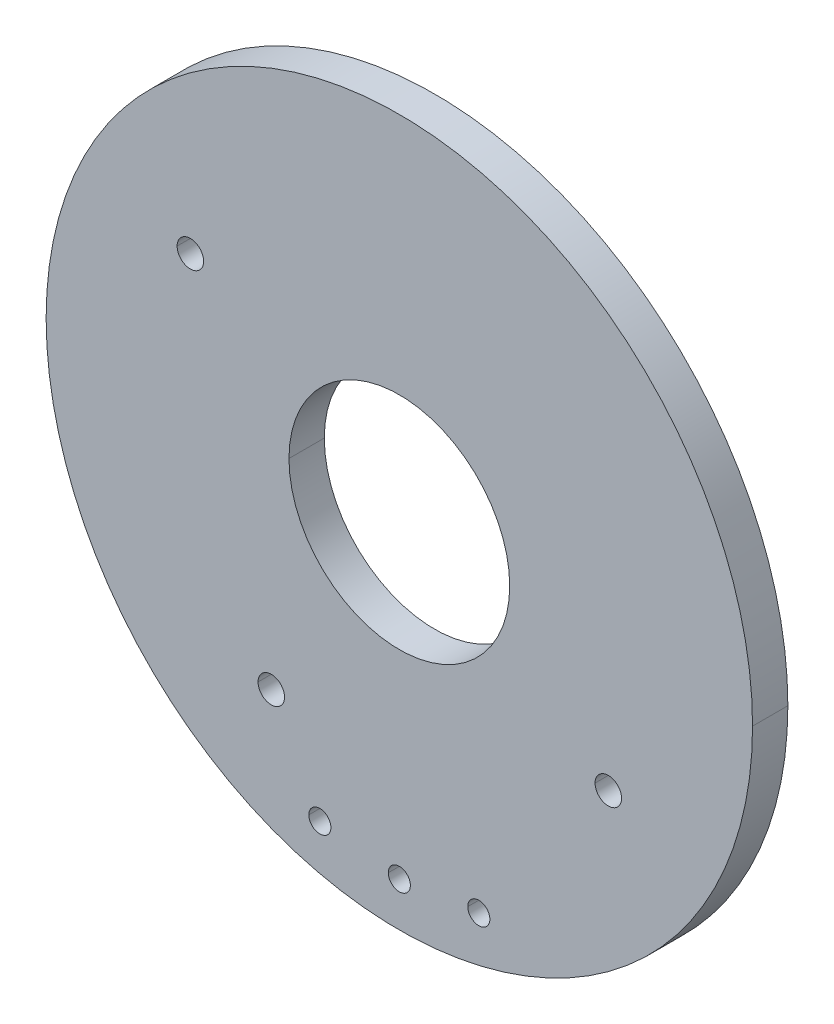
ISO-10303-21;
HEADER;
FILE_DESCRIPTION(('STEP AP214'),'2;1');
FILE_NAME('part.step','',(''),(''),'','','');
FILE_SCHEMA(('AUTOMOTIVE_DESIGN { 1 0 10303 214 1 1 1 1 }'));
ENDSEC;
DATA;
#1=APPLICATION_CONTEXT('core data for automotive mechanical design processes');
#2=APPLICATION_PROTOCOL_DEFINITION('international standard','automotive_design',2000,#1);
#3=PRODUCT_CONTEXT('',#1,'mechanical');
#4=PRODUCT('Part','Part','',(#3));
#5=PRODUCT_RELATED_PRODUCT_CATEGORY('part','',(#4));
#6=PRODUCT_DEFINITION_FORMATION('','',#4);
#7=PRODUCT_DEFINITION_CONTEXT('part definition',#1,'design');
#8=PRODUCT_DEFINITION('design','',#6,#7);
#9=PRODUCT_DEFINITION_SHAPE('','',#8);
#10=(LENGTH_UNIT() NAMED_UNIT(*) SI_UNIT(.MILLI.,.METRE.));
#11=(NAMED_UNIT(*) PLANE_ANGLE_UNIT() SI_UNIT($,.RADIAN.));
#12=(NAMED_UNIT(*) SI_UNIT($,.STERADIAN.) SOLID_ANGLE_UNIT());
#13=UNCERTAINTY_MEASURE_WITH_UNIT(LENGTH_MEASURE(1.E-05),#10,'distance_accuracy_value','');
#14=(GEOMETRIC_REPRESENTATION_CONTEXT(3) GLOBAL_UNCERTAINTY_ASSIGNED_CONTEXT((#13)) GLOBAL_UNIT_ASSIGNED_CONTEXT((#10,
#11,#12)) REPRESENTATION_CONTEXT('',''));
#15=CARTESIAN_POINT('',(0.,0.,0.));
#16=DIRECTION('',(0.,0.,1.));
#17=DIRECTION('',(1.,0.,0.));
#18=AXIS2_PLACEMENT_3D('',#15,#16,#17);
#19=CARTESIAN_POINT('',(0.,0.,0.8));
#20=DIRECTION('',(0.,0.,-1.));
#21=DIRECTION('',(-1.,0.,0.));
#22=AXIS2_PLACEMENT_3D('',#19,#20,#21);
#23=CYLINDRICAL_SURFACE('',#22,2.5);
#24=DIRECTION('',(0.,0.,-1.));
#25=VECTOR('',#24,1.);
#26=CARTESIAN_POINT('',(2.5,0.,0.800000000745));
#27=LINE('',#26,#25);
#28=CARTESIAN_POINT('',(2.5,0.,0.8));
#29=VERTEX_POINT('',#28);
#30=CARTESIAN_POINT('',(2.5,0.,0.));
#31=VERTEX_POINT('',#30);
#32=EDGE_CURVE('E28',#29,#31,#27,.T.);
#33=ORIENTED_EDGE('',*,*,#32,.F.);
#34=CARTESIAN_POINT('',(0.,0.,0.8));
#35=DIRECTION('',(0.,0.,1.));
#36=DIRECTION('',(1.,0.,0.));
#37=AXIS2_PLACEMENT_3D('',#34,#35,#36);
#38=CIRCLE('',#37,2.5);
#39=CARTESIAN_POINT('',(-2.5,0.,0.8));
#40=VERTEX_POINT('',#39);
#41=EDGE_CURVE('E218',#29,#40,#38,.T.);
#42=ORIENTED_EDGE('',*,*,#41,.T.);
#43=DIRECTION('',(0.,0.,-1.));
#44=VECTOR('',#43,1.);
#45=CARTESIAN_POINT('',(-2.5,0.,0.800000000745));
#46=LINE('',#45,#44);
#47=CARTESIAN_POINT('',(-2.5,0.,-7.45058015283E-10));
#48=VERTEX_POINT('',#47);
#49=EDGE_CURVE('E11',#40,#48,#46,.T.);
#50=ORIENTED_EDGE('',*,*,#49,.T.);
#51=CARTESIAN_POINT('',(0.,0.,0.));
#52=DIRECTION('',(0.,0.,1.));
#53=DIRECTION('',(1.,0.,0.));
#54=AXIS2_PLACEMENT_3D('',#51,#52,#53);
#55=CIRCLE('',#54,2.5);
#56=EDGE_CURVE('E201',#31,#48,#55,.T.);
#57=ORIENTED_EDGE('',*,*,#56,.F.);
#58=EDGE_LOOP('',(#33,#42,#50,#57));
#59=FACE_BOUND('',#58,.T.);
#60=ADVANCED_FACE('F17',(#59),#23,.F.);
#61=CARTESIAN_POINT('',(0.,0.,0.8));
#62=DIRECTION('',(0.,0.,-1.));
#63=DIRECTION('',(-1.,0.,0.));
#64=AXIS2_PLACEMENT_3D('',#61,#62,#63);
#65=CYLINDRICAL_SURFACE('',#64,2.5);
#66=CARTESIAN_POINT('',(0.,0.,0.8));
#67=DIRECTION('',(0.,0.,1.));
#68=DIRECTION('',(1.,0.,0.));
#69=AXIS2_PLACEMENT_3D('',#66,#67,#68);
#70=CIRCLE('',#69,2.5);
#71=EDGE_CURVE('E253',#40,#29,#70,.T.);
#72=ORIENTED_EDGE('',*,*,#71,.T.);
#73=ORIENTED_EDGE('',*,*,#32,.T.);
#74=CARTESIAN_POINT('',(0.,0.,0.));
#75=DIRECTION('',(0.,0.,1.));
#76=DIRECTION('',(1.,0.,0.));
#77=AXIS2_PLACEMENT_3D('',#74,#75,#76);
#78=CIRCLE('',#77,2.5);
#79=EDGE_CURVE('E206',#48,#31,#78,.T.);
#80=ORIENTED_EDGE('',*,*,#79,.F.);
#81=ORIENTED_EDGE('',*,*,#49,.F.);
#82=EDGE_LOOP('',(#72,#73,#80,#81));
#83=FACE_BOUND('',#82,.T.);
#84=ADVANCED_FACE('F396',(#83),#65,.F.);
#85=CARTESIAN_POINT('',(0.,-7.,-0.8));
#86=DIRECTION('',(0.,0.,1.));
#87=DIRECTION('',(1.,0.,0.));
#88=AXIS2_PLACEMENT_3D('',#85,#86,#87);
#89=CYLINDRICAL_SURFACE('',#88,0.25);
#90=CARTESIAN_POINT('',(0.,-7.,0.));
#91=DIRECTION('',(0.,0.,1.));
#92=DIRECTION('',(1.,0.,0.));
#93=AXIS2_PLACEMENT_3D('',#90,#91,#92);
#94=CIRCLE('',#93,0.25);
#95=CARTESIAN_POINT('',(-0.25,-7.,7.45058015283E-10));
#96=VERTEX_POINT('',#95);
#97=CARTESIAN_POINT('',(0.25,-7.,0.));
#98=VERTEX_POINT('',#97);
#99=EDGE_CURVE('E238',#96,#98,#94,.T.);
#100=ORIENTED_EDGE('',*,*,#99,.F.);
#101=DIRECTION('',(0.,0.,1.));
#102=VECTOR('',#101,1.);
#103=CARTESIAN_POINT('',(-0.25,-7.,-0.800000000745));
#104=LINE('',#103,#102);
#105=CARTESIAN_POINT('',(-0.25,-7.,0.8));
#106=VERTEX_POINT('',#105);
#107=EDGE_CURVE('E211',#96,#106,#104,.T.);
#108=ORIENTED_EDGE('',*,*,#107,.T.);
#109=CARTESIAN_POINT('',(0.,-7.,0.8));
#110=DIRECTION('',(0.,0.,1.));
#111=DIRECTION('',(1.,0.,0.));
#112=AXIS2_PLACEMENT_3D('',#109,#110,#111);
#113=CIRCLE('',#112,0.25);
#114=CARTESIAN_POINT('',(0.25,-7.,0.799999999627));
#115=VERTEX_POINT('',#114);
#116=EDGE_CURVE('E257',#106,#115,#113,.T.);
#117=ORIENTED_EDGE('',*,*,#116,.T.);
#118=DIRECTION('',(0.,0.,1.));
#119=VECTOR('',#118,1.);
#120=CARTESIAN_POINT('',(0.25,-7.,-0.800000000745));
#121=LINE('',#120,#119);
#122=EDGE_CURVE('E200',#98,#115,#121,.T.);
#123=ORIENTED_EDGE('',*,*,#122,.F.);
#124=EDGE_LOOP('',(#100,#108,#117,#123));
#125=FACE_BOUND('',#124,.T.);
#126=ADVANCED_FACE('F347',(#125),#89,.F.);
#127=CARTESIAN_POINT('',(0.,-7.,-0.8));
#128=DIRECTION('',(0.,0.,1.));
#129=DIRECTION('',(1.,0.,0.));
#130=AXIS2_PLACEMENT_3D('',#127,#128,#129);
#131=CYLINDRICAL_SURFACE('',#130,0.25);
#132=ORIENTED_EDGE('',*,*,#107,.F.);
#133=CARTESIAN_POINT('',(0.,-7.,0.));
#134=DIRECTION('',(0.,0.,1.));
#135=DIRECTION('',(1.,0.,0.));
#136=AXIS2_PLACEMENT_3D('',#133,#134,#135);
#137=CIRCLE('',#136,0.25);
#138=EDGE_CURVE('E234',#98,#96,#137,.T.);
#139=ORIENTED_EDGE('',*,*,#138,.F.);
#140=ORIENTED_EDGE('',*,*,#122,.T.);
#141=CARTESIAN_POINT('',(0.,-7.,0.8));
#142=DIRECTION('',(0.,0.,1.));
#143=DIRECTION('',(1.,0.,0.));
#144=AXIS2_PLACEMENT_3D('',#141,#142,#143);
#145=CIRCLE('',#144,0.25);
#146=EDGE_CURVE('E290',#115,#106,#145,.T.);
#147=ORIENTED_EDGE('',*,*,#146,.T.);
#148=EDGE_LOOP('',(#132,#139,#140,#147));
#149=FACE_BOUND('',#148,.T.);
#150=ADVANCED_FACE('F343',(#149),#131,.F.);
#151=CARTESIAN_POINT('',(-1.8,-6.76461381012,-0.8));
#152=DIRECTION('',(0.,0.,1.));
#153=DIRECTION('',(1.,0.,0.));
#154=AXIS2_PLACEMENT_3D('',#151,#152,#153);
#155=CYLINDRICAL_SURFACE('',#154,0.25);
#156=CARTESIAN_POINT('',(-1.80000000075,-6.76461381093,0.));
#157=DIRECTION('',(0.,0.,1.));
#158=DIRECTION('',(1.,0.,0.));
#159=AXIS2_PLACEMENT_3D('',#156,#157,#158);
#160=CIRCLE('',#159,0.25);
#161=CARTESIAN_POINT('',(-2.05,-6.76461381012,7.45058015283E-10));
#162=VERTEX_POINT('',#161);
#163=CARTESIAN_POINT('',(-1.55000000075,-6.76461381093,0.));
#164=VERTEX_POINT('',#163);
#165=EDGE_CURVE('E239',#162,#164,#160,.T.);
#166=ORIENTED_EDGE('',*,*,#165,.F.);
#167=DIRECTION('',(0.,0.,1.));
#168=VECTOR('',#167,1.);
#169=CARTESIAN_POINT('',(-2.05,-6.76461381012,-0.800000000745));
#170=LINE('',#169,#168);
#171=CARTESIAN_POINT('',(-2.05000000075,-6.76461381093,0.8));
#172=VERTEX_POINT('',#171);
#173=EDGE_CURVE('E197',#162,#172,#170,.T.);
#174=ORIENTED_EDGE('',*,*,#173,.T.);
#175=CARTESIAN_POINT('',(-1.80000000075,-6.76461381093,0.8));
#176=DIRECTION('',(0.,0.,1.));
#177=DIRECTION('',(1.,0.,0.));
#178=AXIS2_PLACEMENT_3D('',#175,#176,#177);
#179=CIRCLE('',#178,0.25);
#180=CARTESIAN_POINT('',(-1.55,-6.76461381012,0.799999999627));
#181=VERTEX_POINT('',#180);
#182=EDGE_CURVE('E251',#172,#181,#179,.T.);
#183=ORIENTED_EDGE('',*,*,#182,.T.);
#184=DIRECTION('',(0.,0.,1.));
#185=VECTOR('',#184,1.);
#186=CARTESIAN_POINT('',(-1.55,-6.76461381012,-0.800000000745));
#187=LINE('',#186,#185);
#188=EDGE_CURVE('E214',#164,#181,#187,.T.);
#189=ORIENTED_EDGE('',*,*,#188,.F.);
#190=EDGE_LOOP('',(#166,#174,#183,#189));
#191=FACE_BOUND('',#190,.T.);
#192=ADVANCED_FACE('F339',(#191),#155,.F.);
#193=CARTESIAN_POINT('',(-1.8,-6.76461381012,-0.8));
#194=DIRECTION('',(0.,0.,1.));
#195=DIRECTION('',(1.,0.,0.));
#196=AXIS2_PLACEMENT_3D('',#193,#194,#195);
#197=CYLINDRICAL_SURFACE('',#196,0.25);
#198=ORIENTED_EDGE('',*,*,#173,.F.);
#199=CARTESIAN_POINT('',(-1.80000000075,-6.76461381093,0.));
#200=DIRECTION('',(0.,0.,1.));
#201=DIRECTION('',(1.,0.,0.));
#202=AXIS2_PLACEMENT_3D('',#199,#200,#201);
#203=CIRCLE('',#202,0.25);
#204=EDGE_CURVE('E246',#164,#162,#203,.T.);
#205=ORIENTED_EDGE('',*,*,#204,.F.);
#206=ORIENTED_EDGE('',*,*,#188,.T.);
#207=CARTESIAN_POINT('',(-1.80000000075,-6.76461381093,0.8));
#208=DIRECTION('',(0.,0.,1.));
#209=DIRECTION('',(1.,0.,0.));
#210=AXIS2_PLACEMENT_3D('',#207,#208,#209);
#211=CIRCLE('',#210,0.25);
#212=EDGE_CURVE('E247',#181,#172,#211,.T.);
#213=ORIENTED_EDGE('',*,*,#212,.T.);
#214=EDGE_LOOP('',(#198,#205,#206,#213));
#215=FACE_BOUND('',#214,.T.);
#216=ADVANCED_FACE('F342',(#215),#197,.F.);
#217=CARTESIAN_POINT('',(1.8,-6.76461381012,-0.8));
#218=DIRECTION('',(0.,0.,1.));
#219=DIRECTION('',(1.,0.,0.));
#220=AXIS2_PLACEMENT_3D('',#217,#218,#219);
#221=CYLINDRICAL_SURFACE('',#220,0.25);
#222=CARTESIAN_POINT('',(1.80000000075,-6.76461381093,0.));
#223=DIRECTION('',(0.,0.,1.));
#224=DIRECTION('',(1.,0.,0.));
#225=AXIS2_PLACEMENT_3D('',#222,#223,#224);
#226=CIRCLE('',#225,0.25);
#227=CARTESIAN_POINT('',(1.55,-6.76461381012,7.45058015283E-10));
#228=VERTEX_POINT('',#227);
#229=CARTESIAN_POINT('',(2.05000000075,-6.76461381093,0.));
#230=VERTEX_POINT('',#229);
#231=EDGE_CURVE('E273',#228,#230,#226,.T.);
#232=ORIENTED_EDGE('',*,*,#231,.F.);
#233=DIRECTION('',(0.,0.,1.));
#234=VECTOR('',#233,1.);
#235=CARTESIAN_POINT('',(1.55,-6.76461381012,-0.800000000745));
#236=LINE('',#235,#234);
#237=CARTESIAN_POINT('',(1.55000000075,-6.76461381093,0.8));
#238=VERTEX_POINT('',#237);
#239=EDGE_CURVE('E194',#228,#238,#236,.T.);
#240=ORIENTED_EDGE('',*,*,#239,.T.);
#241=CARTESIAN_POINT('',(1.80000000075,-6.76461381093,0.8));
#242=DIRECTION('',(0.,0.,1.));
#243=DIRECTION('',(1.,0.,0.));
#244=AXIS2_PLACEMENT_3D('',#241,#242,#243);
#245=CIRCLE('',#244,0.25);
#246=CARTESIAN_POINT('',(2.05,-6.76461381012,0.799999999627));
#247=VERTEX_POINT('',#246);
#248=EDGE_CURVE('E252',#238,#247,#245,.T.);
#249=ORIENTED_EDGE('',*,*,#248,.T.);
#250=DIRECTION('',(0.,0.,1.));
#251=VECTOR('',#250,1.);
#252=CARTESIAN_POINT('',(2.05,-6.76461381012,-0.800000000745));
#253=LINE('',#252,#251);
#254=EDGE_CURVE('E66',#230,#247,#253,.T.);
#255=ORIENTED_EDGE('',*,*,#254,.F.);
#256=EDGE_LOOP('',(#232,#240,#249,#255));
#257=FACE_BOUND('',#256,.T.);
#258=ADVANCED_FACE('F349',(#257),#221,.F.);
#259=CARTESIAN_POINT('',(1.8,-6.76461381012,-0.8));
#260=DIRECTION('',(0.,0.,1.));
#261=DIRECTION('',(1.,0.,0.));
#262=AXIS2_PLACEMENT_3D('',#259,#260,#261);
#263=CYLINDRICAL_SURFACE('',#262,0.25);
#264=ORIENTED_EDGE('',*,*,#239,.F.);
#265=CARTESIAN_POINT('',(1.80000000075,-6.76461381093,0.));
#266=DIRECTION('',(0.,0.,1.));
#267=DIRECTION('',(1.,0.,0.));
#268=AXIS2_PLACEMENT_3D('',#265,#266,#267);
#269=CIRCLE('',#268,0.25);
#270=EDGE_CURVE('E277',#230,#228,#269,.T.);
#271=ORIENTED_EDGE('',*,*,#270,.F.);
#272=ORIENTED_EDGE('',*,*,#254,.T.);
#273=CARTESIAN_POINT('',(1.80000000075,-6.76461381093,0.8));
#274=DIRECTION('',(0.,0.,1.));
#275=DIRECTION('',(1.,0.,0.));
#276=AXIS2_PLACEMENT_3D('',#273,#274,#275);
#277=CIRCLE('',#276,0.25);
#278=EDGE_CURVE('E242',#247,#238,#277,.T.);
#279=ORIENTED_EDGE('',*,*,#278,.T.);
#280=EDGE_LOOP('',(#264,#271,#272,#279));
#281=FACE_BOUND('',#280,.T.);
#282=ADVANCED_FACE('F352',(#281),#263,.F.);
#283=CARTESIAN_POINT('',(4.73299587999,-2.9,-0.8));
#284=DIRECTION('',(0.,0.,1.));
#285=DIRECTION('',(1.,0.,0.));
#286=AXIS2_PLACEMENT_3D('',#283,#284,#285);
#287=CYLINDRICAL_SURFACE('',#286,0.3);
#288=CARTESIAN_POINT('',(4.73299587984,-2.89999999944,0.));
#289=DIRECTION('',(0.,0.,1.));
#290=DIRECTION('',(1.,0.,0.));
#291=AXIS2_PLACEMENT_3D('',#288,#289,#290);
#292=CIRCLE('',#291,0.299999999814);
#293=CARTESIAN_POINT('',(4.43299587999,-2.9,7.45058015283E-10));
#294=VERTEX_POINT('',#293);
#295=CARTESIAN_POINT('',(5.03299587965,-2.90000000037,0.));
#296=VERTEX_POINT('',#295);
#297=EDGE_CURVE('E229',#294,#296,#292,.T.);
#298=ORIENTED_EDGE('',*,*,#297,.F.);
#299=DIRECTION('',(0.,0.,1.));
#300=VECTOR('',#299,1.);
#301=CARTESIAN_POINT('',(4.43299587999,-2.9,-0.800000000745));
#302=LINE('',#301,#300);
#303=CARTESIAN_POINT('',(4.43299588002,-2.90000000037,0.8));
#304=VERTEX_POINT('',#303);
#305=EDGE_CURVE('E83',#294,#304,#302,.T.);
#306=ORIENTED_EDGE('',*,*,#305,.T.);
#307=CARTESIAN_POINT('',(4.73299587984,-2.89999999944,0.8));
#308=DIRECTION('',(0.,0.,1.));
#309=DIRECTION('',(1.,0.,0.));
#310=AXIS2_PLACEMENT_3D('',#307,#308,#309);
#311=CIRCLE('',#310,0.299999999814);
#312=CARTESIAN_POINT('',(5.03299587999,-2.9,0.799999999627));
#313=VERTEX_POINT('',#312);
#314=EDGE_CURVE('E209',#304,#313,#311,.T.);
#315=ORIENTED_EDGE('',*,*,#314,.T.);
#316=DIRECTION('',(0.,0.,1.));
#317=VECTOR('',#316,1.);
#318=CARTESIAN_POINT('',(5.03299587999,-2.9,-0.800000000745));
#319=LINE('',#318,#317);
#320=EDGE_CURVE('E191',#296,#313,#319,.T.);
#321=ORIENTED_EDGE('',*,*,#320,.F.);
#322=EDGE_LOOP('',(#298,#306,#315,#321));
#323=FACE_BOUND('',#322,.T.);
#324=ADVANCED_FACE('F334',(#323),#287,.F.);
#325=CARTESIAN_POINT('',(4.73299587999,-2.9,-0.8));
#326=DIRECTION('',(0.,0.,1.));
#327=DIRECTION('',(1.,0.,0.));
#328=AXIS2_PLACEMENT_3D('',#325,#326,#327);
#329=CYLINDRICAL_SURFACE('',#328,0.3);
#330=ORIENTED_EDGE('',*,*,#305,.F.);
#331=CARTESIAN_POINT('',(4.73299587984,-2.89999999944,0.));
#332=DIRECTION('',(0.,0.,1.));
#333=DIRECTION('',(1.,0.,0.));
#334=AXIS2_PLACEMENT_3D('',#331,#332,#333);
#335=CIRCLE('',#334,0.299999999814);
#336=EDGE_CURVE('E225',#296,#294,#335,.T.);
#337=ORIENTED_EDGE('',*,*,#336,.F.);
#338=ORIENTED_EDGE('',*,*,#320,.T.);
#339=CARTESIAN_POINT('',(4.73299587984,-2.89999999944,0.8));
#340=DIRECTION('',(0.,0.,1.));
#341=DIRECTION('',(1.,0.,0.));
#342=AXIS2_PLACEMENT_3D('',#339,#340,#341);
#343=CIRCLE('',#342,0.299999999814);
#344=EDGE_CURVE('E173',#313,#304,#343,.T.);
#345=ORIENTED_EDGE('',*,*,#344,.T.);
#346=EDGE_LOOP('',(#330,#337,#338,#345));
#347=FACE_BOUND('',#346,.T.);
#348=ADVANCED_FACE('F473',(#347),#329,.F.);
#349=CARTESIAN_POINT('',(-2.9,-4.73299587999,-0.8));
#350=DIRECTION('',(0.,0.,1.));
#351=DIRECTION('',(1.,0.,0.));
#352=AXIS2_PLACEMENT_3D('',#349,#350,#351);
#353=CYLINDRICAL_SURFACE('',#352,0.3);
#354=CARTESIAN_POINT('',(-2.89999999944,-4.73299587984,0.));
#355=DIRECTION('',(0.,0.,1.));
#356=DIRECTION('',(1.,0.,0.));
#357=AXIS2_PLACEMENT_3D('',#354,#355,#356);
#358=CIRCLE('',#357,0.299999999814);
#359=CARTESIAN_POINT('',(-3.2,-4.73299587999,7.45058015283E-10));
#360=VERTEX_POINT('',#359);
#361=CARTESIAN_POINT('',(-2.59999999963,-4.73299588077,0.));
#362=VERTEX_POINT('',#361);
#363=EDGE_CURVE('E221',#360,#362,#358,.T.);
#364=ORIENTED_EDGE('',*,*,#363,.F.);
#365=DIRECTION('',(0.,0.,1.));
#366=VECTOR('',#365,1.);
#367=CARTESIAN_POINT('',(-3.2,-4.73299587999,-0.800000000745));
#368=LINE('',#367,#366);
#369=CARTESIAN_POINT('',(-3.19999999925,-4.73299588077,0.8));
#370=VERTEX_POINT('',#369);
#371=EDGE_CURVE('E167',#360,#370,#368,.T.);
#372=ORIENTED_EDGE('',*,*,#371,.T.);
#373=CARTESIAN_POINT('',(-2.89999999944,-4.73299587984,0.8));
#374=DIRECTION('',(0.,0.,1.));
#375=DIRECTION('',(1.,0.,0.));
#376=AXIS2_PLACEMENT_3D('',#373,#374,#375);
#377=CIRCLE('',#376,0.299999999814);
#378=CARTESIAN_POINT('',(-2.6,-4.73299587999,0.799999999627));
#379=VERTEX_POINT('',#378);
#380=EDGE_CURVE('E170',#370,#379,#377,.T.);
#381=ORIENTED_EDGE('',*,*,#380,.T.);
#382=DIRECTION('',(0.,0.,1.));
#383=VECTOR('',#382,1.);
#384=CARTESIAN_POINT('',(-2.6,-4.73299587999,-0.800000000745));
#385=LINE('',#384,#383);
#386=EDGE_CURVE('E156',#362,#379,#385,.T.);
#387=ORIENTED_EDGE('',*,*,#386,.F.);
#388=EDGE_LOOP('',(#364,#372,#381,#387));
#389=FACE_BOUND('',#388,.T.);
#390=ADVANCED_FACE('F19',(#389),#353,.F.);
#391=CARTESIAN_POINT('',(-2.9,-4.73299587999,-0.8));
#392=DIRECTION('',(0.,0.,1.));
#393=DIRECTION('',(1.,0.,0.));
#394=AXIS2_PLACEMENT_3D('',#391,#392,#393);
#395=CYLINDRICAL_SURFACE('',#394,0.3);
#396=ORIENTED_EDGE('',*,*,#371,.F.);
#397=CARTESIAN_POINT('',(-2.89999999944,-4.73299587984,0.));
#398=DIRECTION('',(0.,0.,1.));
#399=DIRECTION('',(1.,0.,0.));
#400=AXIS2_PLACEMENT_3D('',#397,#398,#399);
#401=CIRCLE('',#400,0.299999999814);
#402=EDGE_CURVE('E162',#362,#360,#401,.T.);
#403=ORIENTED_EDGE('',*,*,#402,.F.);
#404=ORIENTED_EDGE('',*,*,#386,.T.);
#405=CARTESIAN_POINT('',(-2.89999999944,-4.73299587984,0.8));
#406=DIRECTION('',(0.,0.,1.));
#407=DIRECTION('',(1.,0.,0.));
#408=AXIS2_PLACEMENT_3D('',#405,#406,#407);
#409=CIRCLE('',#408,0.299999999814);
#410=EDGE_CURVE('E160',#379,#370,#409,.T.);
#411=ORIENTED_EDGE('',*,*,#410,.T.);
#412=EDGE_LOOP('',(#396,#403,#404,#411));
#413=FACE_BOUND('',#412,.T.);
#414=ADVANCED_FACE('F158',(#413),#395,.F.);
#415=CARTESIAN_POINT('',(0.,0.,0.8));
#416=DIRECTION('',(0.,0.,-1.));
#417=DIRECTION('',(-1.,0.,0.));
#418=AXIS2_PLACEMENT_3D('',#415,#416,#417);
#419=CYLINDRICAL_SURFACE('',#418,8.);
#420=CARTESIAN_POINT('',(0.,0.,0.8));
#421=DIRECTION('',(0.,0.,1.));
#422=DIRECTION('',(1.,0.,0.));
#423=AXIS2_PLACEMENT_3D('',#420,#421,#422);
#424=CIRCLE('',#423,8.);
#425=CARTESIAN_POINT('',(8.,0.,0.8));
#426=VERTEX_POINT('',#425);
#427=CARTESIAN_POINT('',(-8.,0.,0.8));
#428=VERTEX_POINT('',#427);
#429=EDGE_CURVE('E178',#426,#428,#424,.T.);
#430=ORIENTED_EDGE('',*,*,#429,.F.);
#431=DIRECTION('',(0.,0.,-1.));
#432=VECTOR('',#431,1.);
#433=CARTESIAN_POINT('',(8.,0.,0.800000000745));
#434=LINE('',#433,#432);
#435=CARTESIAN_POINT('',(8.,0.,-7.45058015283E-10));
#436=VERTEX_POINT('',#435);
#437=EDGE_CURVE('E148',#426,#436,#434,.T.);
#438=ORIENTED_EDGE('',*,*,#437,.T.);
#439=CARTESIAN_POINT('',(0.,0.,0.));
#440=DIRECTION('',(0.,0.,1.));
#441=DIRECTION('',(1.,0.,0.));
#442=AXIS2_PLACEMENT_3D('',#439,#440,#441);
#443=CIRCLE('',#442,8.);
#444=CARTESIAN_POINT('',(-8.,0.,-7.45058015283E-10));
#445=VERTEX_POINT('',#444);
#446=EDGE_CURVE('E189',#436,#445,#443,.T.);
#447=ORIENTED_EDGE('',*,*,#446,.T.);
#448=DIRECTION('',(0.,0.,-1.));
#449=VECTOR('',#448,1.);
#450=CARTESIAN_POINT('',(-8.,0.,0.800000000745));
#451=LINE('',#450,#449);
#452=EDGE_CURVE('E217',#428,#445,#451,.T.);
#453=ORIENTED_EDGE('',*,*,#452,.F.);
#454=EDGE_LOOP('',(#430,#438,#447,#453));
#455=FACE_BOUND('',#454,.T.);
#456=ADVANCED_FACE('F338',(#455),#419,.T.);
#457=CARTESIAN_POINT('',(0.,0.,0.8));
#458=DIRECTION('',(0.,0.,-1.));
#459=DIRECTION('',(-1.,0.,0.));
#460=AXIS2_PLACEMENT_3D('',#457,#458,#459);
#461=CYLINDRICAL_SURFACE('',#460,8.);
#462=ORIENTED_EDGE('',*,*,#437,.F.);
#463=CARTESIAN_POINT('',(0.,0.,0.8));
#464=DIRECTION('',(0.,0.,1.));
#465=DIRECTION('',(1.,0.,0.));
#466=AXIS2_PLACEMENT_3D('',#463,#464,#465);
#467=CIRCLE('',#466,8.);
#468=EDGE_CURVE('E184',#428,#426,#467,.T.);
#469=ORIENTED_EDGE('',*,*,#468,.F.);
#470=ORIENTED_EDGE('',*,*,#452,.T.);
#471=CARTESIAN_POINT('',(0.,0.,0.));
#472=DIRECTION('',(0.,0.,1.));
#473=DIRECTION('',(1.,0.,0.));
#474=AXIS2_PLACEMENT_3D('',#471,#472,#473);
#475=CIRCLE('',#474,8.);
#476=EDGE_CURVE('E187',#445,#436,#475,.T.);
#477=ORIENTED_EDGE('',*,*,#476,.T.);
#478=EDGE_LOOP('',(#462,#469,#470,#477));
#479=FACE_BOUND('',#478,.T.);
#480=ADVANCED_FACE('F357',(#479),#461,.T.);
#481=CARTESIAN_POINT('',(0.,0.,0.8));
#482=DIRECTION('',(0.,0.,1.));
#483=DIRECTION('',(1.,0.,0.));
#484=AXIS2_PLACEMENT_3D('',#481,#482,#483);
#485=PLANE('',#484);
#486=ORIENTED_EDGE('',*,*,#71,.F.);
#487=ORIENTED_EDGE('',*,*,#41,.F.);
#488=EDGE_LOOP('',(#486,#487));
#489=FACE_BOUND('',#488,.T.);
#490=ORIENTED_EDGE('',*,*,#146,.F.);
#491=ORIENTED_EDGE('',*,*,#116,.F.);
#492=EDGE_LOOP('',(#490,#491));
#493=FACE_BOUND('',#492,.T.);
#494=ORIENTED_EDGE('',*,*,#212,.F.);
#495=ORIENTED_EDGE('',*,*,#182,.F.);
#496=EDGE_LOOP('',(#494,#495));
#497=FACE_BOUND('',#496,.T.);
#498=ORIENTED_EDGE('',*,*,#278,.F.);
#499=ORIENTED_EDGE('',*,*,#248,.F.);
#500=EDGE_LOOP('',(#498,#499));
#501=FACE_BOUND('',#500,.T.);
#502=ORIENTED_EDGE('',*,*,#344,.F.);
#503=ORIENTED_EDGE('',*,*,#314,.F.);
#504=EDGE_LOOP('',(#502,#503));
#505=FACE_BOUND('',#504,.T.);
#506=ORIENTED_EDGE('',*,*,#410,.F.);
#507=ORIENTED_EDGE('',*,*,#380,.F.);
#508=EDGE_LOOP('',(#506,#507));
#509=FACE_BOUND('',#508,.T.);
#510=CARTESIAN_POINT('',(-4.73299587999,2.9,0.799999999627));
#511=DIRECTION('',(0.,0.,1.));
#512=DIRECTION('',(1.,0.,0.));
#513=AXIS2_PLACEMENT_3D('',#510,#511,#512);
#514=CIRCLE('',#513,0.3);
#515=CARTESIAN_POINT('',(-4.43299587999,2.9,0.799999999627));
#516=VERTEX_POINT('',#515);
#517=CARTESIAN_POINT('',(-5.03299587965,2.90000000037,0.8));
#518=VERTEX_POINT('',#517);
#519=EDGE_CURVE('E205',#516,#518,#514,.T.);
#520=ORIENTED_EDGE('',*,*,#519,.F.);
#521=CARTESIAN_POINT('',(-4.73299587999,2.9,0.8));
#522=DIRECTION('',(0.,0.,1.));
#523=DIRECTION('',(-1.,0.,0.));
#524=AXIS2_PLACEMENT_3D('',#521,#522,#523);
#525=CIRCLE('',#524,0.3);
#526=EDGE_CURVE('E422',#518,#516,#525,.T.);
#527=ORIENTED_EDGE('',*,*,#526,.F.);
#528=EDGE_LOOP('',(#520,#527));
#529=FACE_BOUND('',#528,.T.);
#530=ORIENTED_EDGE('',*,*,#468,.T.);
#531=ORIENTED_EDGE('',*,*,#429,.T.);
#532=EDGE_LOOP('',(#530,#531));
#533=FACE_BOUND('',#532,.T.);
#534=ADVANCED_FACE('F175',(#489,#493,#497,#501,#505,#509,#529,#533),#485,.T.);
#535=CARTESIAN_POINT('',(-4.73299587999,2.9,-0.8));
#536=DIRECTION('',(0.,0.,1.));
#537=DIRECTION('',(1.,0.,0.));
#538=AXIS2_PLACEMENT_3D('',#535,#536,#537);
#539=CYLINDRICAL_SURFACE('',#538,0.3);
#540=DIRECTION('',(0.,0.,1.));
#541=VECTOR('',#540,1.);
#542=CARTESIAN_POINT('',(-5.03299587999,2.9,-0.800000000745));
#543=LINE('',#542,#541);
#544=CARTESIAN_POINT('',(-5.03299587999,2.9,7.45058015283E-10));
#545=VERTEX_POINT('',#544);
#546=EDGE_CURVE('E419',#545,#518,#543,.T.);
#547=ORIENTED_EDGE('',*,*,#546,.F.);
#548=CARTESIAN_POINT('',(-4.73299587984,2.89999999944,0.));
#549=DIRECTION('',(0.,0.,1.));
#550=DIRECTION('',(1.,0.,0.));
#551=AXIS2_PLACEMENT_3D('',#548,#549,#550);
#552=CIRCLE('',#551,0.299999999814);
#553=CARTESIAN_POINT('',(-4.43299588002,2.90000000037,0.));
#554=VERTEX_POINT('',#553);
#555=EDGE_CURVE('E222',#554,#545,#552,.T.);
#556=ORIENTED_EDGE('',*,*,#555,.F.);
#557=DIRECTION('',(0.,0.,1.));
#558=VECTOR('',#557,1.);
#559=CARTESIAN_POINT('',(-4.43299587999,2.9,-0.800000000745));
#560=LINE('',#559,#558);
#561=EDGE_CURVE('E190',#554,#516,#560,.T.);
#562=ORIENTED_EDGE('',*,*,#561,.T.);
#563=ORIENTED_EDGE('',*,*,#519,.T.);
#564=EDGE_LOOP('',(#547,#556,#562,#563));
#565=FACE_BOUND('',#564,.T.);
#566=ADVANCED_FACE('F323',(#565),#539,.F.);
#567=CARTESIAN_POINT('',(0.,0.,0.));
#568=DIRECTION('',(0.,0.,1.));
#569=DIRECTION('',(1.,0.,0.));
#570=AXIS2_PLACEMENT_3D('',#567,#568,#569);
#571=PLANE('',#570);
#572=ORIENTED_EDGE('',*,*,#79,.T.);
#573=ORIENTED_EDGE('',*,*,#56,.T.);
#574=EDGE_LOOP('',(#572,#573));
#575=FACE_BOUND('',#574,.T.);
#576=ORIENTED_EDGE('',*,*,#138,.T.);
#577=ORIENTED_EDGE('',*,*,#99,.T.);
#578=EDGE_LOOP('',(#576,#577));
#579=FACE_BOUND('',#578,.T.);
#580=ORIENTED_EDGE('',*,*,#204,.T.);
#581=ORIENTED_EDGE('',*,*,#165,.T.);
#582=EDGE_LOOP('',(#580,#581));
#583=FACE_BOUND('',#582,.T.);
#584=ORIENTED_EDGE('',*,*,#270,.T.);
#585=ORIENTED_EDGE('',*,*,#231,.T.);
#586=EDGE_LOOP('',(#584,#585));
#587=FACE_BOUND('',#586,.T.);
#588=ORIENTED_EDGE('',*,*,#336,.T.);
#589=ORIENTED_EDGE('',*,*,#297,.T.);
#590=EDGE_LOOP('',(#588,#589));
#591=FACE_BOUND('',#590,.T.);
#592=ORIENTED_EDGE('',*,*,#402,.T.);
#593=ORIENTED_EDGE('',*,*,#363,.T.);
#594=EDGE_LOOP('',(#592,#593));
#595=FACE_BOUND('',#594,.T.);
#596=ORIENTED_EDGE('',*,*,#555,.T.);
#597=CARTESIAN_POINT('',(-5.03299587999,2.9,0.));
#598=CARTESIAN_POINT('',(-5.03299587999,2.77625256012512,0.));
#599=CARTESIAN_POINT('',(-4.94513518945699,2.68736129251602,0.));
#600=CARTESIAN_POINT('',(-4.86040387526952,2.60163610781035,0.));
#601=CARTESIAN_POINT('',(-4.73299587999,2.60051544748125,0.));
#602=CARTESIAN_POINT('',(-4.61096812548628,2.59944211088867,0.));
#603=CARTESIAN_POINT('',(-4.52085657052301,2.68736129251602,0.));
#604=CARTESIAN_POINT('',(-4.48012340880044,2.72710343485505,0.));
#605=CARTESIAN_POINT('',(-4.45577112828289,2.78469231108596,0.));
#606=CARTESIAN_POINT('',(-4.43299587999,2.8385517824452,0.));
#607=CARTESIAN_POINT('',(-4.43299587999,2.9,0.));
#608=B_SPLINE_CURVE_WITH_KNOTS('',2,(#597,#598,#599,#600,#601,#602,#603,#604,#605,#606,#607),
.UNSPECIFIED.,.F.,.F.,(3,2,2,2,2,3),(0.,0.25,0.5,0.75,0.875,1.),.UNSPECIFIED.);
#609=EDGE_CURVE('E379',#545,#554,#608,.T.);
#610=ORIENTED_EDGE('',*,*,#609,.T.);
#611=EDGE_LOOP('',(#596,#610));
#612=FACE_BOUND('',#611,.T.);
#613=ORIENTED_EDGE('',*,*,#476,.F.);
#614=ORIENTED_EDGE('',*,*,#446,.F.);
#615=EDGE_LOOP('',(#613,#614));
#616=FACE_BOUND('',#615,.T.);
#617=ADVANCED_FACE('F333',(#575,#579,#583,#587,#591,#595,#612,#616),#571,.F.);
#618=CARTESIAN_POINT('',(-4.73299587999,2.9,-0.8));
#619=DIRECTION('',(0.,0.,1.));
#620=DIRECTION('',(1.,0.,0.));
#621=AXIS2_PLACEMENT_3D('',#618,#619,#620);
#622=CYLINDRICAL_SURFACE('',#621,0.3);
#623=ORIENTED_EDGE('',*,*,#609,.F.);
#624=ORIENTED_EDGE('',*,*,#546,.T.);
#625=ORIENTED_EDGE('',*,*,#526,.T.);
#626=ORIENTED_EDGE('',*,*,#561,.F.);
#627=EDGE_LOOP('',(#623,#624,#625,#626));
#628=FACE_BOUND('',#627,.T.);
#629=ADVANCED_FACE('F394',(#628),#622,.F.);
#630=CLOSED_SHELL('',(#60,#84,#126,#150,#192,#216,#258,#282,#324,#348,#390,#414,#456,#480,#534,
#566,#617,#629));
#631=MANIFOLD_SOLID_BREP('B1',#630);
#632=ADVANCED_BREP_SHAPE_REPRESENTATION('',(#18,#631),#14);
#633=SHAPE_DEFINITION_REPRESENTATION(#9,#632);
ENDSEC;
END-ISO-10303-21;
